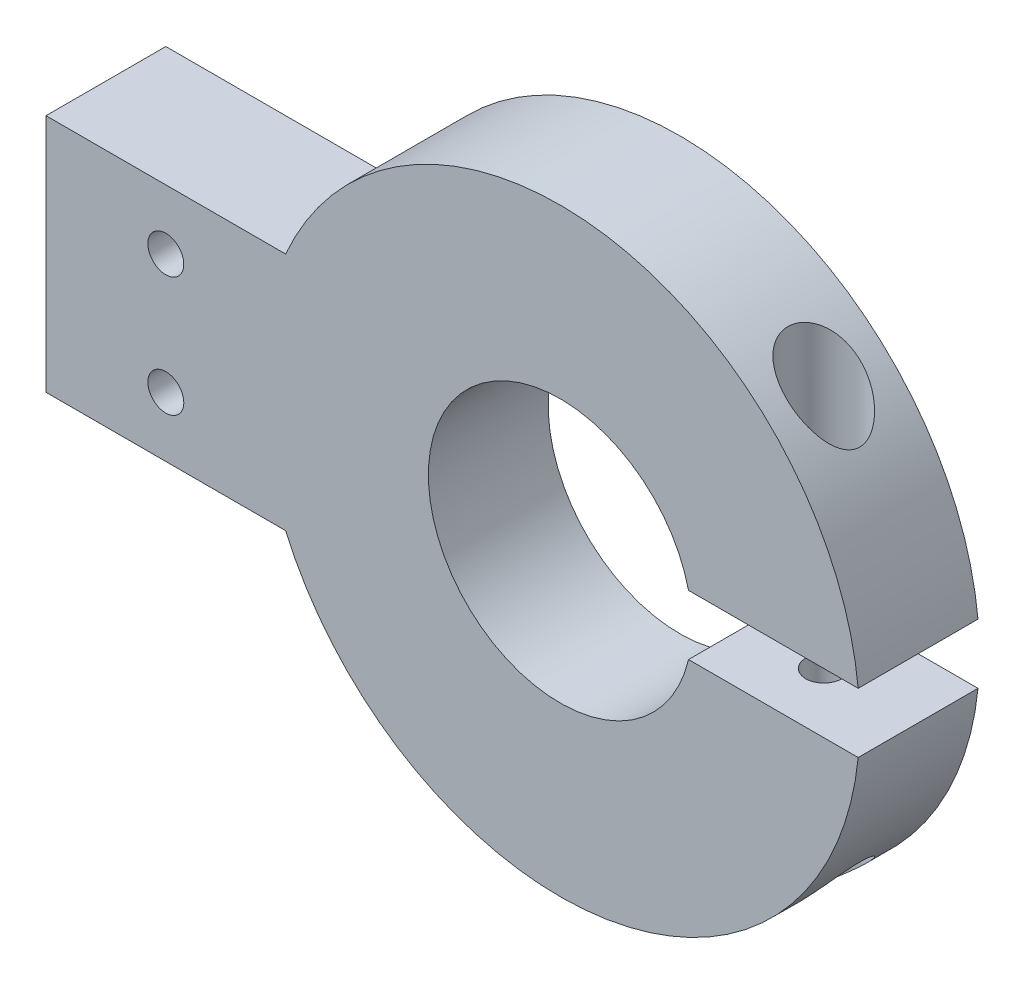
ISO-10303-21;
HEADER;
FILE_DESCRIPTION(('STEP AP214'),'2;1');
FILE_NAME('part.step','',(''),(''),'','','');
FILE_SCHEMA(('AUTOMOTIVE_DESIGN { 1 0 10303 214 1 1 1 1 }'));
ENDSEC;
DATA;
#1=APPLICATION_CONTEXT('core data for automotive mechanical design processes');
#2=APPLICATION_PROTOCOL_DEFINITION('international standard','automotive_design',2000,#1);
#3=PRODUCT_CONTEXT('',#1,'mechanical');
#4=PRODUCT('Part','Part','',(#3));
#5=PRODUCT_RELATED_PRODUCT_CATEGORY('part','',(#4));
#6=PRODUCT_DEFINITION_FORMATION('','',#4);
#7=PRODUCT_DEFINITION_CONTEXT('part definition',#1,'design');
#8=PRODUCT_DEFINITION('design','',#6,#7);
#9=PRODUCT_DEFINITION_SHAPE('','',#8);
#10=(LENGTH_UNIT() NAMED_UNIT(*) SI_UNIT(.MILLI.,.METRE.));
#11=(NAMED_UNIT(*) PLANE_ANGLE_UNIT() SI_UNIT($,.RADIAN.));
#12=(NAMED_UNIT(*) SI_UNIT($,.STERADIAN.) SOLID_ANGLE_UNIT());
#13=UNCERTAINTY_MEASURE_WITH_UNIT(LENGTH_MEASURE(1.E-05),#10,'distance_accuracy_value','');
#14=(GEOMETRIC_REPRESENTATION_CONTEXT(3) GLOBAL_UNCERTAINTY_ASSIGNED_CONTEXT((#13)) GLOBAL_UNIT_ASSIGNED_CONTEXT((#10,
#11,#12)) REPRESENTATION_CONTEXT('',''));
#15=CARTESIAN_POINT('',(0.,0.,0.));
#16=DIRECTION('',(0.,0.,1.));
#17=DIRECTION('',(1.,0.,0.));
#18=AXIS2_PLACEMENT_3D('',#15,#16,#17);
#19=CARTESIAN_POINT('',(0.,0.,10.));
#20=DIRECTION('',(0.,0.,-1.));
#21=DIRECTION('',(-1.,0.,0.));
#22=AXIS2_PLACEMENT_3D('',#19,#20,#21);
#23=CYLINDRICAL_SURFACE('',#22,25.);
#24=CARTESIAN_POINT('',(17.,-18.3303027798234,2.));
#25=CARTESIAN_POINT('',(16.8140401606612,-18.5027610612053,1.99999710766442));
#26=CARTESIAN_POINT('',(16.6252887721841,-18.6725190967379,2.01725510069127));
#27=CARTESIAN_POINT('',(16.2466179194314,-19.0029072495664,2.08974859336446));
#28=CARTESIAN_POINT('',(16.0566978815545,-19.1635324087441,2.14500451242364));
#29=CARTESIAN_POINT('',(15.715679786478,-19.4436925840915,2.28373094524258));
#30=CARTESIAN_POINT('',(15.5636823323292,-19.5654560347408,2.3604393755136));
#31=CARTESIAN_POINT('',(15.2686384883705,-19.7965560228225,2.54389492800638));
#32=CARTESIAN_POINT('',(15.1255791219454,-19.9059107733483,2.65059720426463));
#33=CARTESIAN_POINT('',(14.8787406156942,-20.090859398109,2.87329482187158));
#34=CARTESIAN_POINT('',(14.7724685271042,-20.1690124792044,2.98439656141839));
#35=CARTESIAN_POINT('',(14.5749790263628,-20.3121846634454,3.22696835875074));
#36=CARTESIAN_POINT('',(14.4837586889449,-20.3772063191987,3.358434449129));
#37=CARTESIAN_POINT('',(14.3617276532877,-20.4632184041301,3.56953368067486));
#38=CARTESIAN_POINT('',(14.3233845894027,-20.4900593351895,3.64256155323009));
#39=CARTESIAN_POINT('',(14.2524021670375,-20.5394960031247,3.79269465807995));
#40=CARTESIAN_POINT('',(14.2197598864147,-20.5620939153621,3.8697977749014));
#41=CARTESIAN_POINT('',(14.1607537005613,-20.6027751908885,4.02749624087493));
#42=CARTESIAN_POINT('',(14.134387674398,-20.6208600793622,4.10809039938735));
#43=CARTESIAN_POINT('',(14.0884118377558,-20.6522981194292,4.27204710051677));
#44=CARTESIAN_POINT('',(14.068800958028,-20.6656520198838,4.35540920271306));
#45=CARTESIAN_POINT('',(14.0249045268211,-20.6954889060972,4.58646288855546));
#46=CARTESIAN_POINT('',(14.0078303957098,-20.7070214388281,4.73627439883965));
#47=CARTESIAN_POINT('',(13.9964536707986,-20.7147128814954,5.03703103768131));
#48=CARTESIAN_POINT('',(14.0021404356776,-20.7108789756472,5.18797560356587));
#49=CARTESIAN_POINT('',(14.0347122077961,-20.6888178809743,5.47608336355922));
#50=CARTESIAN_POINT('',(14.0601438456167,-20.6715773838938,5.61349008313125));
#51=CARTESIAN_POINT('',(14.1290659442082,-20.6245295934783,5.88140694806694));
#52=CARTESIAN_POINT('',(14.1725566162263,-20.5947221531403,6.01191701273623));
#53=CARTESIAN_POINT('',(14.2769826443092,-20.5224727620665,6.26676722131207));
#54=CARTESIAN_POINT('',(14.3383938310575,-20.4796847201093,6.39081265151822));
#55=CARTESIAN_POINT('',(14.4752919981412,-20.3831530295275,6.62616353943635));
#56=CARTESIAN_POINT('',(14.5507832584469,-20.3294060492108,6.7374651067038));
#57=CARTESIAN_POINT('',(14.7217738262459,-20.2059798579109,6.9573270839997));
#58=CARTESIAN_POINT('',(14.8185568901493,-20.1352028497239,7.06426792156798));
#59=CARTESIAN_POINT('',(15.0221110894259,-19.9838018066207,7.26007679165523));
#60=CARTESIAN_POINT('',(15.1288887954216,-19.9031712830668,7.34893281138632));
#61=CARTESIAN_POINT('',(15.397511502096,-19.6966068632913,7.54367784467636));
#62=CARTESIAN_POINT('',(15.5629873823627,-19.5663011617983,7.63997459929427));
#63=CARTESIAN_POINT('',(15.9002716891272,-19.2932321579006,7.79739111981555));
#64=CARTESIAN_POINT('',(16.072091648245,-19.1504454505434,7.85844308985107));
#65=CARTESIAN_POINT('',(16.4630867506714,-18.8161941957753,7.96019842144821));
#66=CARTESIAN_POINT('',(16.682535465613,-18.6219874335363,7.9909726470543));
#67=CARTESIAN_POINT('',(17.0067573444802,-18.3246286825176,8.00194668666178));
#68=CARTESIAN_POINT('',(17.1140943297895,-18.2244141225281,7.99972342583997));
#69=CARTESIAN_POINT('',(17.3265662518856,-18.022529178901,7.98407288179903));
#70=CARTESIAN_POINT('',(17.4317011410941,-17.920858763888,7.97064535675691));
#71=CARTESIAN_POINT('',(17.745782169119,-17.6117548756196,7.91368162413629));
#72=CARTESIAN_POINT('',(17.9505631830615,-17.4028368009764,7.85338868473127));
#73=CARTESIAN_POINT('',(18.2458164096125,-17.0912515620385,7.73116828893516));
#74=CARTESIAN_POINT('',(18.3422734905596,-16.9876592711618,7.68511371351154));
#75=CARTESIAN_POINT('',(18.5308156092143,-16.7817840212504,7.5822726427827));
#76=CARTESIAN_POINT('',(18.6229017129689,-16.6795007474477,7.52548878126863));
#77=CARTESIAN_POINT('',(18.7816747944475,-16.5002910804935,7.41510586946804));
#78=CARTESIAN_POINT('',(18.8493743152936,-16.4228894447554,7.36372081906598));
#79=CARTESIAN_POINT('',(18.981435322334,-16.2700737456138,7.25416804068402));
#80=CARTESIAN_POINT('',(19.0457975354809,-16.1946592511344,7.19600179886747));
#81=CARTESIAN_POINT('',(19.1706791910293,-16.046632699335,7.0726424851318));
#82=CARTESIAN_POINT('',(19.2312033147313,-15.9740172721373,7.00745824557052));
#83=CARTESIAN_POINT('',(19.3478851400821,-15.8324904581072,6.86964749549217));
#84=CARTESIAN_POINT('',(19.4040447313489,-15.7635774723423,6.79702423761304));
#85=CARTESIAN_POINT('',(19.5279497391812,-15.6099860813251,6.62003354423605));
#86=CARTESIAN_POINT('',(19.5938728351622,-15.5270626514846,6.5128142432668));
#87=CARTESIAN_POINT('',(19.7144132882703,-15.3737244272893,6.28398724855298));
#88=CARTESIAN_POINT('',(19.7690479421946,-15.3032905196108,6.16240202329731));
#89=CARTESIAN_POINT('',(19.8526708407286,-15.194573283486,5.93456584845097));
#90=CARTESIAN_POINT('',(19.8846672979912,-15.152621163252,5.83119837280821));
#91=CARTESIAN_POINT('',(19.9378830161159,-15.0825319940879,5.61721728350213));
#92=CARTESIAN_POINT('',(19.9591136772785,-15.0543803323964,5.50661147554924));
#93=CARTESIAN_POINT('',(19.9891308883661,-15.0145031967716,5.27976441329737));
#94=CARTESIAN_POINT('',(19.9978129758637,-15.0029156216338,5.16348408948391));
#95=CARTESIAN_POINT('',(20.0014535144008,-14.9980623663559,4.93033268662636));
#96=CARTESIAN_POINT('',(19.9964160966312,-15.0047911708228,4.81346179599071));
#97=CARTESIAN_POINT('',(19.9746190070194,-15.0337901610751,4.59753336023283));
#98=CARTESIAN_POINT('',(19.9593607207109,-15.0540690642509,4.49803903952996));
#99=CARTESIAN_POINT('',(19.9198454849737,-15.1063174120926,4.30407348495149));
#100=CARTESIAN_POINT('',(19.8955840271615,-15.1382927136743,4.20960479483002));
#101=CARTESIAN_POINT('',(19.8264723336824,-15.228772767959,3.98484557993483));
#102=CARTESIAN_POINT('',(19.7772858066203,-15.2927137256035,3.85809069640699));
#103=CARTESIAN_POINT('',(19.6664528588186,-15.4349851807253,3.61887348279472));
#104=CARTESIAN_POINT('',(19.6047757644284,-15.5133510581236,3.50644747022361));
#105=CARTESIAN_POINT('',(19.4876491378043,-15.6600820231342,3.32052697539216));
#106=CARTESIAN_POINT('',(19.4341866898387,-15.7264171272796,3.24411975097954));
#107=CARTESIAN_POINT('',(19.3225526121867,-15.8633780393941,3.09891002507614));
#108=CARTESIAN_POINT('',(19.2643785589521,-15.9340060508216,3.03011148091881));
#109=CARTESIAN_POINT('',(19.1439089296849,-16.0785454288386,2.89963036503192));
#110=CARTESIAN_POINT('',(19.0816059022384,-16.1524626477902,2.83796124180929));
#111=CARTESIAN_POINT('',(18.9534622550349,-16.3026384963606,2.72151795915938));
#112=CARTESIAN_POINT('',(18.8876207176866,-16.3788977310824,2.66674560060141));
#113=CARTESIAN_POINT('',(18.7265208665326,-16.5631412392214,2.54377881587738));
#114=CARTESIAN_POINT('',(18.6297957175982,-16.6719103702089,2.47866891450942));
#115=CARTESIAN_POINT('',(18.4310650417788,-16.8913522810528,2.36079512362874));
#116=CARTESIAN_POINT('',(18.3290570965558,-17.0020259169873,2.30803695055364));
#117=CARTESIAN_POINT('',(18.12064310715,-17.2239781609855,2.21483159520541));
#118=CARTESIAN_POINT('',(18.014245652051,-17.3352552490465,2.17436155577982));
#119=CARTESIAN_POINT('',(17.7975342462368,-17.5576726952131,2.10572117160654));
#120=CARTESIAN_POINT('',(17.6872224339215,-17.6688130946731,2.07754421972849));
#121=CARTESIAN_POINT('',(17.4814361958058,-17.8722350545915,2.03734054728631));
#122=CARTESIAN_POINT('',(17.3864590696715,-17.9646501087993,2.02343497767206));
#123=CARTESIAN_POINT('',(17.1945781425598,-18.1483927612353,2.00476497835949));
#124=CARTESIAN_POINT('',(17.0976741381298,-18.2397202429852,2.00000151917955));
#125=CARTESIAN_POINT('',(17.,-18.3303027798234,2.));
#126=B_SPLINE_CURVE_WITH_KNOTS('',3,(#24,#25,#26,#27,#28,#29,#30,#31,#32,#33,#34,#35,#36,#37,
#38,#39,#40,#41,#42,#43,#44,#45,#46,#47,#48,#49,#50,#51,#52,#53,#54,#55,#56,#57,#58,#59,#60,#61,
#62,#63,#64,#65,#66,#67,#68,#69,#70,#71,#72,#73,#74,#75,#76,#77,#78,#79,#80,#81,#82,#83,#84,#85,
#86,#87,#88,#89,#90,#91,#92,#93,#94,#95,#96,#97,#98,#99,#100,#101,#102,#103,#104,#105,#106,#107,
#108,#109,#110,#111,#112,#113,#114,#115,#116,#117,#118,#119,#120,#121,#122,#123,#124,#125),
.UNSPECIFIED.,.T.,.F.,(4,2,2,2,2,2,2,2,2,2,2,2,2,2,2,2,2,2,2,2,2,2,2,2,2,2,2,2,2,2,2,2,2,2,2,2,
2,2,2,2,2,2,2,2,2,2,2,2,2,2,4),(0.,0.760508290018189,1.52142558342394,2.14707194049911,
2.77178777926202,3.28718426416111,3.8024804648925,4.06237576878921,4.32213746042552,
4.58181124586215,4.84144390951806,5.29247546328059,5.74329617249487,6.16375672385938,
6.58422219373865,7.0170648433462,7.45003928075283,7.93018247139456,8.41064356229434,
9.10159572046387,9.79387258360615,10.6728605778441,11.1130960399243,11.5533410039057,
12.4452871040273,12.891513896838,13.3376312932846,13.6822643735797,14.0268220657037,
14.3709510816066,14.7149302675909,15.1657941001381,15.6159618844939,15.9628298888269,
16.3093298106821,16.6586979299211,17.007960859744,17.3147136743027,17.621620304621,
18.0698486956874,18.5191914683013,18.8620658702229,19.2051177733245,19.5488065794431,
19.8925849436027,20.3702989684853,20.8482336465289,21.3252737940967,21.8020572314612,
22.2014666286436,22.6009184244303),.UNSPECIFIED.);
#127=CARTESIAN_POINT('',(17.,-18.3303027798234,2.));
#128=VERTEX_POINT('',#127);
#129=EDGE_CURVE('E38',#128,#128,#126,.T.);
#130=ORIENTED_EDGE('',*,*,#129,.T.);
#131=EDGE_LOOP('',(#130));
#132=FACE_BOUND('',#131,.T.);
#133=CARTESIAN_POINT('',(0.,0.,10.));
#134=DIRECTION('',(0.,0.,1.));
#135=DIRECTION('',(1.,0.,0.));
#136=AXIS2_PLACEMENT_3D('',#133,#134,#135);
#137=CIRCLE('',#136,25.);
#138=CARTESIAN_POINT('',(-22.9138692452306,-9.99772955287719,10.));
#139=VERTEX_POINT('',#138);
#140=CARTESIAN_POINT('',(24.8746859276655,-2.5,10.));
#141=VERTEX_POINT('',#140);
#142=EDGE_CURVE('E53',#139,#141,#137,.T.);
#143=ORIENTED_EDGE('',*,*,#142,.F.);
#144=DIRECTION('',(0.,0.,-1.));
#145=VECTOR('',#144,1.);
#146=CARTESIAN_POINT('',(-22.9138692452306,-9.9977295528772,10.));
#147=LINE('',#146,#145);
#148=CARTESIAN_POINT('',(-22.9138692452306,-9.9977295528772,0.));
#149=VERTEX_POINT('',#148);
#150=EDGE_CURVE('E152',#139,#149,#147,.T.);
#151=ORIENTED_EDGE('',*,*,#150,.T.);
#152=CARTESIAN_POINT('',(0.,0.,0.));
#153=DIRECTION('',(0.,0.,1.));
#154=DIRECTION('',(1.,0.,0.));
#155=AXIS2_PLACEMENT_3D('',#152,#153,#154);
#156=CIRCLE('',#155,25.);
#157=CARTESIAN_POINT('',(24.8746859276655,-2.5,0.));
#158=VERTEX_POINT('',#157);
#159=EDGE_CURVE('E255',#149,#158,#156,.T.);
#160=ORIENTED_EDGE('',*,*,#159,.T.);
#161=DIRECTION('',(0.,0.,-1.));
#162=VECTOR('',#161,1.);
#163=CARTESIAN_POINT('',(24.8746859276655,-2.5,10.));
#164=LINE('',#163,#162);
#165=EDGE_CURVE('E243',#158,#141,#164,.F.);
#166=ORIENTED_EDGE('',*,*,#165,.T.);
#167=EDGE_LOOP('',(#143,#151,#160,#166));
#168=FACE_BOUND('',#167,.T.);
#169=ADVANCED_FACE('F33',(#132,#168),#23,.T.);
#170=CARTESIAN_POINT('',(18.1547005383792,-7.49999999999998,7.));
#171=DIRECTION('',(-0.866025403784439,0.,-0.5));
#172=DIRECTION('',(-0.5,0.,0.866025403784439));
#173=AXIS2_PLACEMENT_3D('',#170,#171,#172);
#174=PLANE('',#173);
#175=DIRECTION('',(0.,-1.,0.));
#176=VECTOR('',#175,1.);
#177=CARTESIAN_POINT('',(19.3094010767585,-7.49999999999998,5.));
#178=LINE('',#177,#176);
#179=CARTESIAN_POINT('',(19.3094010767585,-7.49999999999998,5.));
#180=VERTEX_POINT('',#179);
#181=CARTESIAN_POINT('',(19.3094010767585,-12.5,5.));
#182=VERTEX_POINT('',#181);
#183=EDGE_CURVE('E223',#180,#182,#178,.T.);
#184=ORIENTED_EDGE('',*,*,#183,.T.);
#185=DIRECTION('',(-0.5,0.,0.866025403784439));
#186=VECTOR('',#185,1.);
#187=CARTESIAN_POINT('',(18.1547005383792,-12.5,7.));
#188=LINE('',#187,#186);
#189=CARTESIAN_POINT('',(18.1547005383792,-12.5,7.));
#190=VERTEX_POINT('',#189);
#191=EDGE_CURVE('E192',#182,#190,#188,.T.);
#192=ORIENTED_EDGE('',*,*,#191,.T.);
#193=DIRECTION('',(0.,-1.,0.));
#194=VECTOR('',#193,1.);
#195=CARTESIAN_POINT('',(18.1547005383792,-7.49999999999998,7.));
#196=LINE('',#195,#194);
#197=CARTESIAN_POINT('',(18.1547005383792,-7.49999999999998,7.));
#198=VERTEX_POINT('',#197);
#199=EDGE_CURVE('E208',#198,#190,#196,.T.);
#200=ORIENTED_EDGE('',*,*,#199,.F.);
#201=DIRECTION('',(0.5,0.,-0.866025403784439));
#202=VECTOR('',#201,1.);
#203=CARTESIAN_POINT('',(18.1547005383792,-7.49999999999998,7.));
#204=LINE('',#203,#202);
#205=EDGE_CURVE('E195',#198,#180,#204,.T.);
#206=ORIENTED_EDGE('',*,*,#205,.T.);
#207=EDGE_LOOP('',(#184,#192,#200,#206));
#208=FACE_BOUND('',#207,.T.);
#209=ADVANCED_FACE('F308',(#208),#174,.T.);
#210=CARTESIAN_POINT('',(19.3094010767585,-7.49999999999998,5.));
#211=DIRECTION('',(-0.866025403784438,0.,0.5));
#212=DIRECTION('',(0.5,0.,0.866025403784438));
#213=AXIS2_PLACEMENT_3D('',#210,#211,#212);
#214=PLANE('',#213);
#215=DIRECTION('',(0.,-1.,0.));
#216=VECTOR('',#215,1.);
#217=CARTESIAN_POINT('',(18.1547005383792,-7.49999999999998,3.));
#218=LINE('',#217,#216);
#219=CARTESIAN_POINT('',(18.1547005383792,-7.49999999999998,3.));
#220=VERTEX_POINT('',#219);
#221=CARTESIAN_POINT('',(18.1547005383792,-12.5,3.));
#222=VERTEX_POINT('',#221);
#223=EDGE_CURVE('E220',#220,#222,#218,.T.);
#224=ORIENTED_EDGE('',*,*,#223,.T.);
#225=DIRECTION('',(0.5,0.,0.866025403784438));
#226=VECTOR('',#225,1.);
#227=CARTESIAN_POINT('',(19.3094010767585,-12.5,5.));
#228=LINE('',#227,#226);
#229=EDGE_CURVE('E189',#222,#182,#228,.T.);
#230=ORIENTED_EDGE('',*,*,#229,.T.);
#231=ORIENTED_EDGE('',*,*,#183,.F.);
#232=DIRECTION('',(-0.5,0.,-0.866025403784438));
#233=VECTOR('',#232,1.);
#234=CARTESIAN_POINT('',(19.3094010767585,-7.49999999999998,5.));
#235=LINE('',#234,#233);
#236=EDGE_CURVE('E198',#180,#220,#235,.T.);
#237=ORIENTED_EDGE('',*,*,#236,.T.);
#238=EDGE_LOOP('',(#224,#230,#231,#237));
#239=FACE_BOUND('',#238,.T.);
#240=ADVANCED_FACE('F313',(#239),#214,.T.);
#241=CARTESIAN_POINT('',(18.1547005383792,-7.49999999999998,3.));
#242=DIRECTION('',(0.,0.,1.));
#243=DIRECTION('',(1.,0.,0.));
#244=AXIS2_PLACEMENT_3D('',#241,#242,#243);
#245=PLANE('',#244);
#246=DIRECTION('',(0.,-1.,0.));
#247=VECTOR('',#246,1.);
#248=CARTESIAN_POINT('',(15.8452994616208,-7.49999999999998,3.));
#249=LINE('',#248,#247);
#250=CARTESIAN_POINT('',(15.8452994616208,-7.49999999999998,3.));
#251=VERTEX_POINT('',#250);
#252=CARTESIAN_POINT('',(15.8452994616208,-12.5,3.));
#253=VERTEX_POINT('',#252);
#254=EDGE_CURVE('E217',#251,#253,#249,.T.);
#255=ORIENTED_EDGE('',*,*,#254,.T.);
#256=DIRECTION('',(1.,0.,0.));
#257=VECTOR('',#256,1.);
#258=CARTESIAN_POINT('',(18.1547005383792,-12.5,3.));
#259=LINE('',#258,#257);
#260=EDGE_CURVE('E186',#253,#222,#259,.T.);
#261=ORIENTED_EDGE('',*,*,#260,.T.);
#262=ORIENTED_EDGE('',*,*,#223,.F.);
#263=DIRECTION('',(-1.,0.,0.));
#264=VECTOR('',#263,1.);
#265=CARTESIAN_POINT('',(18.1547005383792,-7.49999999999998,3.));
#266=LINE('',#265,#264);
#267=EDGE_CURVE('E200',#220,#251,#266,.T.);
#268=ORIENTED_EDGE('',*,*,#267,.T.);
#269=EDGE_LOOP('',(#255,#261,#262,#268));
#270=FACE_BOUND('',#269,.T.);
#271=ADVANCED_FACE('F396',(#270),#245,.T.);
#272=CARTESIAN_POINT('',(15.8452994616208,-7.49999999999998,3.));
#273=DIRECTION('',(0.866025403784438,0.,0.500000000000002));
#274=DIRECTION('',(0.500000000000002,0.,-0.866025403784438));
#275=AXIS2_PLACEMENT_3D('',#272,#273,#274);
#276=PLANE('',#275);
#277=DIRECTION('',(0.,-1.,0.));
#278=VECTOR('',#277,1.);
#279=CARTESIAN_POINT('',(14.6905989232415,-7.49999999999998,5.));
#280=LINE('',#279,#278);
#281=CARTESIAN_POINT('',(14.6905989232415,-7.49999999999998,5.));
#282=VERTEX_POINT('',#281);
#283=CARTESIAN_POINT('',(14.6905989232415,-12.5,5.));
#284=VERTEX_POINT('',#283);
#285=EDGE_CURVE('E214',#282,#284,#280,.T.);
#286=ORIENTED_EDGE('',*,*,#285,.T.);
#287=DIRECTION('',(0.500000000000002,0.,-0.866025403784438));
#288=VECTOR('',#287,1.);
#289=CARTESIAN_POINT('',(15.8452994616208,-12.5,3.));
#290=LINE('',#289,#288);
#291=EDGE_CURVE('E183',#284,#253,#290,.T.);
#292=ORIENTED_EDGE('',*,*,#291,.T.);
#293=ORIENTED_EDGE('',*,*,#254,.F.);
#294=DIRECTION('',(-0.500000000000002,0.,0.866025403784437));
#295=VECTOR('',#294,1.);
#296=CARTESIAN_POINT('',(15.8452994616208,-7.49999999999998,3.));
#297=LINE('',#296,#295);
#298=EDGE_CURVE('E202',#251,#282,#297,.T.);
#299=ORIENTED_EDGE('',*,*,#298,.T.);
#300=EDGE_LOOP('',(#286,#292,#293,#299));
#301=FACE_BOUND('',#300,.T.);
#302=ADVANCED_FACE('F392',(#301),#276,.T.);
#303=CARTESIAN_POINT('',(14.6905989232415,-7.49999999999998,5.));
#304=DIRECTION('',(0.866025403784438,0.,-0.500000000000002));
#305=DIRECTION('',(-0.500000000000002,0.,-0.866025403784438));
#306=AXIS2_PLACEMENT_3D('',#303,#304,#305);
#307=PLANE('',#306);
#308=DIRECTION('',(0.,-1.,0.));
#309=VECTOR('',#308,1.);
#310=CARTESIAN_POINT('',(15.8452994616208,-7.49999999999998,7.));
#311=LINE('',#310,#309);
#312=CARTESIAN_POINT('',(15.8452994616208,-7.49999999999998,7.));
#313=VERTEX_POINT('',#312);
#314=CARTESIAN_POINT('',(15.8452994616208,-12.5,7.));
#315=VERTEX_POINT('',#314);
#316=EDGE_CURVE('E211',#313,#315,#311,.T.);
#317=ORIENTED_EDGE('',*,*,#316,.T.);
#318=DIRECTION('',(-0.500000000000002,0.,-0.866025403784438));
#319=VECTOR('',#318,1.);
#320=CARTESIAN_POINT('',(14.6905989232415,-12.5,5.));
#321=LINE('',#320,#319);
#322=EDGE_CURVE('E180',#315,#284,#321,.T.);
#323=ORIENTED_EDGE('',*,*,#322,.T.);
#324=ORIENTED_EDGE('',*,*,#285,.F.);
#325=DIRECTION('',(0.500000000000002,0.,0.866025403784437));
#326=VECTOR('',#325,1.);
#327=CARTESIAN_POINT('',(14.6905989232415,-7.49999999999998,5.));
#328=LINE('',#327,#326);
#329=EDGE_CURVE('E204',#282,#313,#328,.T.);
#330=ORIENTED_EDGE('',*,*,#329,.T.);
#331=EDGE_LOOP('',(#317,#323,#324,#330));
#332=FACE_BOUND('',#331,.T.);
#333=ADVANCED_FACE('F323',(#332),#307,.T.);
#334=CARTESIAN_POINT('',(15.8452994616208,-7.49999999999998,7.));
#335=DIRECTION('',(0.,0.,-1.));
#336=DIRECTION('',(-1.,0.,0.));
#337=AXIS2_PLACEMENT_3D('',#334,#335,#336);
#338=PLANE('',#337);
#339=ORIENTED_EDGE('',*,*,#199,.T.);
#340=DIRECTION('',(-1.,0.,0.));
#341=VECTOR('',#340,1.);
#342=CARTESIAN_POINT('',(15.8452994616208,-12.5,7.));
#343=LINE('',#342,#341);
#344=EDGE_CURVE('E11',#190,#315,#343,.T.);
#345=ORIENTED_EDGE('',*,*,#344,.T.);
#346=ORIENTED_EDGE('',*,*,#316,.F.);
#347=DIRECTION('',(1.,0.,0.));
#348=VECTOR('',#347,1.);
#349=CARTESIAN_POINT('',(15.8452994616208,-7.49999999999998,7.));
#350=LINE('',#349,#348);
#351=EDGE_CURVE('E206',#313,#198,#350,.T.);
#352=ORIENTED_EDGE('',*,*,#351,.T.);
#353=EDGE_LOOP('',(#339,#345,#346,#352));
#354=FACE_BOUND('',#353,.T.);
#355=ADVANCED_FACE('F317',(#354),#338,.T.);
#356=CARTESIAN_POINT('',(24.8746859276655,2.5,0.));
#357=VERTEX_POINT('',#356);
#358=CARTESIAN_POINT('',(-22.9138692452306,9.99772955287719,0.));
#359=VERTEX_POINT('',#358);
#360=EDGE_CURVE('E261',#357,#359,#156,.T.);
#361=ORIENTED_EDGE('',*,*,#360,.T.);
#362=DIRECTION('',(0.,0.,-1.));
#363=VECTOR('',#362,1.);
#364=CARTESIAN_POINT('',(-22.9138692452306,9.9977295528772,10.));
#365=LINE('',#364,#363);
#366=CARTESIAN_POINT('',(-22.9138692452306,9.99772955287719,10.));
#367=VERTEX_POINT('',#366);
#368=EDGE_CURVE('E61',#367,#359,#365,.T.);
#369=ORIENTED_EDGE('',*,*,#368,.F.);
#370=CARTESIAN_POINT('',(24.8746859276655,2.5,10.));
#371=VERTEX_POINT('',#370);
#372=EDGE_CURVE('E258',#371,#367,#137,.T.);
#373=ORIENTED_EDGE('',*,*,#372,.F.);
#374=DIRECTION('',(0.,0.,-1.));
#375=VECTOR('',#374,1.);
#376=CARTESIAN_POINT('',(24.8746859276655,2.5,10.));
#377=LINE('',#376,#375);
#378=EDGE_CURVE('E248',#371,#357,#377,.T.);
#379=ORIENTED_EDGE('',*,*,#378,.T.);
#380=EDGE_LOOP('',(#361,#369,#373,#379));
#381=FACE_BOUND('',#380,.T.);
#382=CARTESIAN_POINT('',(17.,18.3303027798234,8.));
#383=CARTESIAN_POINT('',(16.8140401606612,18.5027610612053,8.00000289233558));
#384=CARTESIAN_POINT('',(16.6252887721841,18.6725190967379,7.98274489930873));
#385=CARTESIAN_POINT('',(16.2466179194314,19.0029072495664,7.91025140663554));
#386=CARTESIAN_POINT('',(16.0566978815545,19.1635324087441,7.85499548757636));
#387=CARTESIAN_POINT('',(15.715679786478,19.4436925840915,7.71626905475742));
#388=CARTESIAN_POINT('',(15.5636823323292,19.5654560347408,7.63956062448641));
#389=CARTESIAN_POINT('',(15.2686384883705,19.7965560228225,7.45610507199363));
#390=CARTESIAN_POINT('',(15.1255791219454,19.9059107733483,7.34940279573537));
#391=CARTESIAN_POINT('',(14.8787406156942,20.090859398109,7.12670517812842));
#392=CARTESIAN_POINT('',(14.7724685271042,20.1690124792044,7.01560343858161));
#393=CARTESIAN_POINT('',(14.5749790263628,20.3121846634454,6.77303164124926));
#394=CARTESIAN_POINT('',(14.4837586889449,20.3772063191987,6.64156555087099));
#395=CARTESIAN_POINT('',(14.3617276532877,20.4632184041301,6.43046631932514));
#396=CARTESIAN_POINT('',(14.3233845894027,20.4900593351895,6.35743844676991));
#397=CARTESIAN_POINT('',(14.2524021670375,20.5394960031247,6.20730534192005));
#398=CARTESIAN_POINT('',(14.2197598864147,20.5620939153621,6.13020222509859));
#399=CARTESIAN_POINT('',(14.1607537005613,20.6027751908885,5.97250375912507));
#400=CARTESIAN_POINT('',(14.134387674398,20.6208600793622,5.89190960061265));
#401=CARTESIAN_POINT('',(14.0884118377558,20.6522981194292,5.72795289948323));
#402=CARTESIAN_POINT('',(14.068800958028,20.6656520198838,5.64459079728694));
#403=CARTESIAN_POINT('',(14.0249045268211,20.6954889060972,5.41353711144453));
#404=CARTESIAN_POINT('',(14.0078303957098,20.7070214388281,5.26372560116034));
#405=CARTESIAN_POINT('',(13.9964536707986,20.7147128814954,4.96296896231868));
#406=CARTESIAN_POINT('',(14.0021404356776,20.7108789756472,4.81202439643412));
#407=CARTESIAN_POINT('',(14.0347122077961,20.6888178809743,4.52391663644077));
#408=CARTESIAN_POINT('',(14.0601438456167,20.6715773838938,4.38650991686875));
#409=CARTESIAN_POINT('',(14.1290659442082,20.6245295934783,4.11859305193305));
#410=CARTESIAN_POINT('',(14.1725566162263,20.5947221531403,3.98808298726377));
#411=CARTESIAN_POINT('',(14.2769826443092,20.5224727620665,3.73323277868793));
#412=CARTESIAN_POINT('',(14.3383938310575,20.4796847201093,3.60918734848177));
#413=CARTESIAN_POINT('',(14.4752919981412,20.3831530295275,3.37383646056365));
#414=CARTESIAN_POINT('',(14.5507832584469,20.3294060492108,3.2625348932962));
#415=CARTESIAN_POINT('',(14.721773826246,20.2059798579109,3.0426729160003));
#416=CARTESIAN_POINT('',(14.8185568901493,20.1352028497238,2.93573207843202));
#417=CARTESIAN_POINT('',(15.0221110894259,19.9838018066207,2.73992320834477));
#418=CARTESIAN_POINT('',(15.1288887954216,19.9031712830668,2.65106718861368));
#419=CARTESIAN_POINT('',(15.397511502096,19.6966068632913,2.45632215532364));
#420=CARTESIAN_POINT('',(15.5629873823627,19.5663011617983,2.36002540070573));
#421=CARTESIAN_POINT('',(15.9002716891272,19.2932321579006,2.20260888018445));
#422=CARTESIAN_POINT('',(16.072091648245,19.1504454505433,2.14155691014892));
#423=CARTESIAN_POINT('',(16.4630867506714,18.8161941957753,2.03980157855179));
#424=CARTESIAN_POINT('',(16.682535465613,18.6219874335363,2.0090273529457));
#425=CARTESIAN_POINT('',(17.0067573444802,18.3246286825176,1.99805331333822));
#426=CARTESIAN_POINT('',(17.1140943297895,18.2244141225281,2.00027657416004));
#427=CARTESIAN_POINT('',(17.3265662518856,18.022529178901,2.01592711820097));
#428=CARTESIAN_POINT('',(17.4317011410941,17.920858763888,2.02935464324309));
#429=CARTESIAN_POINT('',(17.745782169119,17.6117548756196,2.08631837586372));
#430=CARTESIAN_POINT('',(17.9505631830615,17.4028368009764,2.14661131526873));
#431=CARTESIAN_POINT('',(18.2458164096125,17.0912515620385,2.26883171106484));
#432=CARTESIAN_POINT('',(18.3422734905596,16.9876592711618,2.31488628648846));
#433=CARTESIAN_POINT('',(18.5308156092143,16.7817840212504,2.4177273572173));
#434=CARTESIAN_POINT('',(18.6229017129689,16.6795007474477,2.47451121873137));
#435=CARTESIAN_POINT('',(18.7816747944475,16.5002910804935,2.58489413053197));
#436=CARTESIAN_POINT('',(18.8493743152936,16.4228894447554,2.63627918093403));
#437=CARTESIAN_POINT('',(18.981435322334,16.2700737456138,2.74583195931599));
#438=CARTESIAN_POINT('',(19.0457975354809,16.1946592511344,2.80399820113254));
#439=CARTESIAN_POINT('',(19.1706791910293,16.046632699335,2.92735751486821));
#440=CARTESIAN_POINT('',(19.2312033147313,15.9740172721373,2.99254175442949));
#441=CARTESIAN_POINT('',(19.3478851400821,15.8324904581072,3.13035250450784));
#442=CARTESIAN_POINT('',(19.4040447313489,15.7635774723423,3.20297576238697));
#443=CARTESIAN_POINT('',(19.5279497391812,15.6099860813251,3.37996645576396));
#444=CARTESIAN_POINT('',(19.5938728351622,15.5270626514846,3.48718575673321));
#445=CARTESIAN_POINT('',(19.7144132882703,15.3737244272893,3.71601275144703));
#446=CARTESIAN_POINT('',(19.7690479421946,15.3032905196108,3.83759797670269));
#447=CARTESIAN_POINT('',(19.8526708407286,15.194573283486,4.06543415154903));
#448=CARTESIAN_POINT('',(19.8846672979912,15.152621163252,4.1688016271918));
#449=CARTESIAN_POINT('',(19.9378830161159,15.0825319940879,4.38278271649788));
#450=CARTESIAN_POINT('',(19.9591136772785,15.0543803323964,4.49338852445076));
#451=CARTESIAN_POINT('',(19.9891308883661,15.0145031967716,4.72023558670264));
#452=CARTESIAN_POINT('',(19.9978129758637,15.0029156216338,4.8365159105161));
#453=CARTESIAN_POINT('',(20.0014535144008,14.9980623663559,5.06966731337365));
#454=CARTESIAN_POINT('',(19.9964160966312,15.0047911708228,5.18653820400929));
#455=CARTESIAN_POINT('',(19.9746190070194,15.0337901610751,5.40246663976717));
#456=CARTESIAN_POINT('',(19.9593607207109,15.0540690642509,5.50196096047004));
#457=CARTESIAN_POINT('',(19.9198454849737,15.1063174120926,5.69592651504851));
#458=CARTESIAN_POINT('',(19.8955840271615,15.1382927136743,5.79039520516998));
#459=CARTESIAN_POINT('',(19.8264723336824,15.228772767959,6.01515442006517));
#460=CARTESIAN_POINT('',(19.7772858066203,15.2927137256035,6.141909303593));
#461=CARTESIAN_POINT('',(19.6664528588186,15.4349851807253,6.38112651720527));
#462=CARTESIAN_POINT('',(19.6047757644284,15.5133510581236,6.49355252977639));
#463=CARTESIAN_POINT('',(19.4876491378043,15.6600820231342,6.67947302460784));
#464=CARTESIAN_POINT('',(19.4341866898387,15.7264171272796,6.75588024902046));
#465=CARTESIAN_POINT('',(19.3225526121867,15.8633780393941,6.90108997492385));
#466=CARTESIAN_POINT('',(19.2643785589521,15.9340060508216,6.96988851908118));
#467=CARTESIAN_POINT('',(19.1439089296849,16.0785454288386,7.10036963496807));
#468=CARTESIAN_POINT('',(19.0816059022384,16.1524626477902,7.16203875819071));
#469=CARTESIAN_POINT('',(18.9534622550349,16.3026384963605,7.27848204084061));
#470=CARTESIAN_POINT('',(18.8876207176866,16.3788977310824,7.33325439939858));
#471=CARTESIAN_POINT('',(18.7265208665326,16.5631412392214,7.45622118412262));
#472=CARTESIAN_POINT('',(18.6297957175982,16.6719103702089,7.52133108549057));
#473=CARTESIAN_POINT('',(18.4310650417788,16.8913522810528,7.63920487637126));
#474=CARTESIAN_POINT('',(18.3290570965558,17.0020259169873,7.69196304944636));
#475=CARTESIAN_POINT('',(18.12064310715,17.2239781609855,7.78516840479459));
#476=CARTESIAN_POINT('',(18.014245652051,17.3352552490465,7.82563844422017));
#477=CARTESIAN_POINT('',(17.7975342462368,17.5576726952131,7.89427882839346));
#478=CARTESIAN_POINT('',(17.6872224339215,17.6688130946731,7.92245578027151));
#479=CARTESIAN_POINT('',(17.4814361958058,17.8722350545915,7.96265945271369));
#480=CARTESIAN_POINT('',(17.3864590696715,17.9646501087993,7.97656502232794));
#481=CARTESIAN_POINT('',(17.1945781425598,18.1483927612353,7.99523502164051));
#482=CARTESIAN_POINT('',(17.0976741381298,18.2397202429852,7.99999848082045));
#483=CARTESIAN_POINT('',(17.,18.3303027798234,8.));
#484=B_SPLINE_CURVE_WITH_KNOTS('',3,(#382,#383,#384,#385,#386,#387,#388,#389,#390,#391,#392,
#393,#394,#395,#396,#397,#398,#399,#400,#401,#402,#403,#404,#405,#406,#407,#408,#409,#410,#411,
#412,#413,#414,#415,#416,#417,#418,#419,#420,#421,#422,#423,#424,#425,#426,#427,#428,#429,#430,
#431,#432,#433,#434,#435,#436,#437,#438,#439,#440,#441,#442,#443,#444,#445,#446,#447,#448,#449,
#450,#451,#452,#453,#454,#455,#456,#457,#458,#459,#460,#461,#462,#463,#464,#465,#466,#467,#468,
#469,#470,#471,#472,#473,#474,#475,#476,#477,#478,#479,#480,#481,#482,#483),.UNSPECIFIED.,.T.,
.F.,(4,2,2,2,2,2,2,2,2,2,2,2,2,2,2,2,2,2,2,2,2,2,2,2,2,2,2,2,2,2,2,2,2,2,2,2,2,2,2,2,2,2,2,2,2,
2,2,2,2,2,4),(0.,0.760508290018189,1.52142558342393,2.1470719404991,2.77178777926202,
3.28718426416112,3.80248046489251,4.06237576878922,4.32213746042552,4.58181124586216,
4.84144390951806,5.29247546328059,5.74329617249488,6.16375672385939,6.58422219373866,
7.01706484334621,7.45003928075283,7.93018247139457,8.41064356229435,9.10159572046388,
9.79387258360616,10.6728605778441,11.1130960399243,11.5533410039057,12.4452871040273,
12.891513896838,13.3376312932846,13.6822643735798,14.0268220657037,14.3709510816066,
14.7149302675909,15.1657941001381,15.6159618844939,15.9628298888269,16.3093298106821,
16.6586979299211,17.007960859744,17.3147136743027,17.621620304621,18.0698486956874,
18.5191914683013,18.8620658702228,19.2051177733245,19.548806579443,19.8925849436027,
20.3702989684853,20.8482336465289,21.3252737940967,21.8020572314612,22.2014666286436,
22.6009184244303),.UNSPECIFIED.);
#485=CARTESIAN_POINT('',(17.,18.3303027798234,8.));
#486=VERTEX_POINT('',#485);
#487=EDGE_CURVE('E267',#486,#486,#484,.T.);
#488=ORIENTED_EDGE('',*,*,#487,.T.);
#489=EDGE_LOOP('',(#488));
#490=FACE_BOUND('',#489,.T.);
#491=ADVANCED_FACE('F35',(#381,#490),#23,.T.);
#492=CARTESIAN_POINT('',(17.,-25.,5.));
#493=DIRECTION('',(0.,1.,0.));
#494=DIRECTION('',(0.,0.,1.));
#495=AXIS2_PLACEMENT_3D('',#492,#493,#494);
#496=CYLINDRICAL_SURFACE('',#495,1.5);
#497=CARTESIAN_POINT('',(17.,2.5,5.));
#498=DIRECTION('',(0.,1.,0.));
#499=DIRECTION('',(-1.,0.,0.));
#500=AXIS2_PLACEMENT_3D('',#497,#498,#499);
#501=CIRCLE('',#500,1.5);
#502=CARTESIAN_POINT('',(15.5,2.5,5.));
#503=VERTEX_POINT('',#502);
#504=EDGE_CURVE('E235',#503,#503,#501,.T.);
#505=ORIENTED_EDGE('',*,*,#504,.F.);
#506=EDGE_LOOP('',(#505));
#507=FACE_BOUND('',#506,.T.);
#508=CARTESIAN_POINT('',(17.,7.49999999999999,5.));
#509=DIRECTION('',(0.,1.,0.));
#510=DIRECTION('',(0.,0.,1.));
#511=AXIS2_PLACEMENT_3D('',#508,#509,#510);
#512=CIRCLE('',#511,1.5);
#513=CARTESIAN_POINT('',(17.,7.49999999999999,6.5));
#514=VERTEX_POINT('',#513);
#515=EDGE_CURVE('E230',#514,#514,#512,.F.);
#516=ORIENTED_EDGE('',*,*,#515,.F.);
#517=EDGE_LOOP('',(#516));
#518=FACE_BOUND('',#517,.T.);
#519=ADVANCED_FACE('F288',(#507,#518),#496,.F.);
#520=CARTESIAN_POINT('',(0.,0.,10.));
#521=DIRECTION('',(0.,0.,1.));
#522=DIRECTION('',(1.,0.,0.));
#523=AXIS2_PLACEMENT_3D('',#520,#521,#522);
#524=PLANE('',#523);
#525=ORIENTED_EDGE('',*,*,#372,.T.);
#526=DIRECTION('',(1.,0.,0.));
#527=VECTOR('',#526,1.);
#528=CARTESIAN_POINT('',(-42.9138692452306,9.9977295528772,10.));
#529=LINE('',#528,#527);
#530=CARTESIAN_POINT('',(-42.9138692452306,9.9977295528772,10.));
#531=VERTEX_POINT('',#530);
#532=EDGE_CURVE('E158',#531,#367,#529,.T.);
#533=ORIENTED_EDGE('',*,*,#532,.F.);
#534=DIRECTION('',(0.,1.,0.));
#535=VECTOR('',#534,1.);
#536=CARTESIAN_POINT('',(-42.9138692452306,-9.99772955287719,10.));
#537=LINE('',#536,#535);
#538=CARTESIAN_POINT('',(-42.9138692452306,-9.99772955287719,10.));
#539=VERTEX_POINT('',#538);
#540=EDGE_CURVE('E145',#539,#531,#537,.T.);
#541=ORIENTED_EDGE('',*,*,#540,.F.);
#542=DIRECTION('',(-1.,0.,0.));
#543=VECTOR('',#542,1.);
#544=CARTESIAN_POINT('',(-22.9138692452306,-9.9977295528772,10.));
#545=LINE('',#544,#543);
#546=EDGE_CURVE('E155',#139,#539,#545,.T.);
#547=ORIENTED_EDGE('',*,*,#546,.F.);
#548=ORIENTED_EDGE('',*,*,#142,.T.);
#549=DIRECTION('',(1.,0.,0.));
#550=VECTOR('',#549,1.);
#551=CARTESIAN_POINT('',(0.,-2.5,10.));
#552=LINE('',#551,#550);
#553=CARTESIAN_POINT('',(10.7121426428143,-2.5,10.));
#554=VERTEX_POINT('',#553);
#555=EDGE_CURVE('E234',#554,#141,#552,.T.);
#556=ORIENTED_EDGE('',*,*,#555,.F.);
#557=CARTESIAN_POINT('',(0.,0.,10.));
#558=DIRECTION('',(0.,0.,1.));
#559=DIRECTION('',(1.,0.,0.));
#560=AXIS2_PLACEMENT_3D('',#557,#558,#559);
#561=CIRCLE('',#560,11.);
#562=CARTESIAN_POINT('',(10.7121426428143,2.5,10.));
#563=VERTEX_POINT('',#562);
#564=EDGE_CURVE('E252',#563,#554,#561,.T.);
#565=ORIENTED_EDGE('',*,*,#564,.F.);
#566=DIRECTION('',(-1.,0.,0.));
#567=VECTOR('',#566,1.);
#568=CARTESIAN_POINT('',(25.,2.5,10.));
#569=LINE('',#568,#567);
#570=EDGE_CURVE('E240',#371,#563,#569,.T.);
#571=ORIENTED_EDGE('',*,*,#570,.F.);
#572=EDGE_LOOP('',(#525,#533,#541,#547,#548,#556,#565,#571));
#573=FACE_BOUND('',#572,.T.);
#574=CARTESIAN_POINT('',(-32.9138692452306,-5.,10.));
#575=DIRECTION('',(0.,0.,-1.));
#576=DIRECTION('',(1.,0.,0.));
#577=AXIS2_PLACEMENT_3D('',#574,#575,#576);
#578=CIRCLE('',#577,1.5);
#579=CARTESIAN_POINT('',(-31.4138692452306,-5.,10.));
#580=VERTEX_POINT('',#579);
#581=EDGE_CURVE('E346',#580,#580,#578,.T.);
#582=ORIENTED_EDGE('',*,*,#581,.T.);
#583=EDGE_LOOP('',(#582));
#584=FACE_BOUND('',#583,.T.);
#585=CARTESIAN_POINT('',(-32.9138692452306,5.,10.));
#586=DIRECTION('',(0.,0.,-1.));
#587=DIRECTION('',(-1.,0.,0.));
#588=AXIS2_PLACEMENT_3D('',#585,#586,#587);
#589=CIRCLE('',#588,1.5);
#590=CARTESIAN_POINT('',(-34.4138692452306,5.,10.));
#591=VERTEX_POINT('',#590);
#592=EDGE_CURVE('E172',#591,#591,#589,.T.);
#593=ORIENTED_EDGE('',*,*,#592,.T.);
#594=EDGE_LOOP('',(#593));
#595=FACE_BOUND('',#594,.T.);
#596=ADVANCED_FACE('F161',(#573,#584,#595),#524,.T.);
#597=CARTESIAN_POINT('',(0.,0.,0.));
#598=DIRECTION('',(0.,0.,1.));
#599=DIRECTION('',(1.,0.,0.));
#600=AXIS2_PLACEMENT_3D('',#597,#598,#599);
#601=PLANE('',#600);
#602=ORIENTED_EDGE('',*,*,#159,.F.);
#603=DIRECTION('',(-1.,0.,0.));
#604=VECTOR('',#603,1.);
#605=CARTESIAN_POINT('',(-22.9138692452306,-9.9977295528772,0.));
#606=LINE('',#605,#604);
#607=CARTESIAN_POINT('',(-42.9138692452306,-9.99772955287719,0.));
#608=VERTEX_POINT('',#607);
#609=EDGE_CURVE('E171',#149,#608,#606,.T.);
#610=ORIENTED_EDGE('',*,*,#609,.T.);
#611=DIRECTION('',(0.,1.,0.));
#612=VECTOR('',#611,1.);
#613=CARTESIAN_POINT('',(-42.9138692452306,-9.99772955287719,0.));
#614=LINE('',#613,#612);
#615=CARTESIAN_POINT('',(-42.9138692452306,9.9977295528772,0.));
#616=VERTEX_POINT('',#615);
#617=EDGE_CURVE('E147',#608,#616,#614,.T.);
#618=ORIENTED_EDGE('',*,*,#617,.T.);
#619=DIRECTION('',(1.,0.,0.));
#620=VECTOR('',#619,1.);
#621=CARTESIAN_POINT('',(-42.9138692452306,9.9977295528772,0.));
#622=LINE('',#621,#620);
#623=EDGE_CURVE('E168',#616,#359,#622,.T.);
#624=ORIENTED_EDGE('',*,*,#623,.T.);
#625=ORIENTED_EDGE('',*,*,#360,.F.);
#626=DIRECTION('',(-1.,0.,0.));
#627=VECTOR('',#626,1.);
#628=CARTESIAN_POINT('',(25.,2.5,0.));
#629=LINE('',#628,#627);
#630=CARTESIAN_POINT('',(10.7121426428143,2.5,0.));
#631=VERTEX_POINT('',#630);
#632=EDGE_CURVE('E239',#357,#631,#629,.T.);
#633=ORIENTED_EDGE('',*,*,#632,.T.);
#634=CARTESIAN_POINT('',(0.,0.,0.));
#635=DIRECTION('',(0.,0.,1.));
#636=DIRECTION('',(1.,0.,0.));
#637=AXIS2_PLACEMENT_3D('',#634,#635,#636);
#638=CIRCLE('',#637,11.);
#639=CARTESIAN_POINT('',(10.7121426428143,-2.5,0.));
#640=VERTEX_POINT('',#639);
#641=EDGE_CURVE('E251',#631,#640,#638,.T.);
#642=ORIENTED_EDGE('',*,*,#641,.T.);
#643=DIRECTION('',(1.,0.,0.));
#644=VECTOR('',#643,1.);
#645=CARTESIAN_POINT('',(0.,-2.5,0.));
#646=LINE('',#645,#644);
#647=EDGE_CURVE('E236',#640,#158,#646,.T.);
#648=ORIENTED_EDGE('',*,*,#647,.T.);
#649=EDGE_LOOP('',(#602,#610,#618,#624,#625,#633,#642,#648));
#650=FACE_BOUND('',#649,.T.);
#651=CARTESIAN_POINT('',(-32.9138692452306,-5.,0.));
#652=DIRECTION('',(0.,0.,-1.));
#653=DIRECTION('',(1.,0.,0.));
#654=AXIS2_PLACEMENT_3D('',#651,#652,#653);
#655=CIRCLE('',#654,1.5);
#656=CARTESIAN_POINT('',(-31.4138692452306,-5.,0.));
#657=VERTEX_POINT('',#656);
#658=EDGE_CURVE('E349',#657,#657,#655,.T.);
#659=ORIENTED_EDGE('',*,*,#658,.F.);
#660=EDGE_LOOP('',(#659));
#661=FACE_BOUND('',#660,.T.);
#662=CARTESIAN_POINT('',(-32.9138692452306,5.,0.));
#663=DIRECTION('',(0.,0.,-1.));
#664=DIRECTION('',(-1.,0.,0.));
#665=AXIS2_PLACEMENT_3D('',#662,#663,#664);
#666=CIRCLE('',#665,1.5);
#667=CARTESIAN_POINT('',(-34.4138692452306,5.,0.));
#668=VERTEX_POINT('',#667);
#669=EDGE_CURVE('E343',#668,#668,#666,.T.);
#670=ORIENTED_EDGE('',*,*,#669,.F.);
#671=EDGE_LOOP('',(#670));
#672=FACE_BOUND('',#671,.T.);
#673=ADVANCED_FACE('F299',(#650,#661,#672),#601,.F.);
#674=CARTESIAN_POINT('',(0.,0.,10.));
#675=DIRECTION('',(0.,0.,-1.));
#676=DIRECTION('',(-1.,0.,0.));
#677=AXIS2_PLACEMENT_3D('',#674,#675,#676);
#678=CYLINDRICAL_SURFACE('',#677,11.);
#679=DIRECTION('',(0.,0.,-1.));
#680=VECTOR('',#679,1.);
#681=CARTESIAN_POINT('',(10.7121426428143,2.5,10.));
#682=LINE('',#681,#680);
#683=EDGE_CURVE('E46',#563,#631,#682,.T.);
#684=ORIENTED_EDGE('',*,*,#683,.F.);
#685=ORIENTED_EDGE('',*,*,#564,.T.);
#686=DIRECTION('',(0.,0.,-1.));
#687=VECTOR('',#686,1.);
#688=CARTESIAN_POINT('',(10.7121426428143,-2.5,10.));
#689=LINE('',#688,#687);
#690=EDGE_CURVE('E260',#640,#554,#689,.F.);
#691=ORIENTED_EDGE('',*,*,#690,.F.);
#692=ORIENTED_EDGE('',*,*,#641,.F.);
#693=EDGE_LOOP('',(#684,#685,#691,#692));
#694=FACE_BOUND('',#693,.T.);
#695=ADVANCED_FACE('F295',(#694),#678,.F.);
#696=CARTESIAN_POINT('',(0.,-2.5,0.));
#697=DIRECTION('',(0.,-1.,0.));
#698=DIRECTION('',(0.,0.,-1.));
#699=AXIS2_PLACEMENT_3D('',#696,#697,#698);
#700=PLANE('',#699);
#701=CARTESIAN_POINT('',(17.,-2.5,5.));
#702=DIRECTION('',(0.,-1.,0.));
#703=DIRECTION('',(0.,0.,-1.));
#704=AXIS2_PLACEMENT_3D('',#701,#702,#703);
#705=CIRCLE('',#704,1.5);
#706=CARTESIAN_POINT('',(17.,-2.5,3.5));
#707=VERTEX_POINT('',#706);
#708=EDGE_CURVE('E231',#707,#707,#705,.T.);
#709=ORIENTED_EDGE('',*,*,#708,.T.);
#710=EDGE_LOOP('',(#709));
#711=FACE_BOUND('',#710,.T.);
#712=ORIENTED_EDGE('',*,*,#647,.F.);
#713=ORIENTED_EDGE('',*,*,#690,.T.);
#714=ORIENTED_EDGE('',*,*,#555,.T.);
#715=ORIENTED_EDGE('',*,*,#165,.F.);
#716=EDGE_LOOP('',(#712,#713,#714,#715));
#717=FACE_BOUND('',#716,.T.);
#718=ADVANCED_FACE('F291',(#711,#717),#700,.F.);
#719=CARTESIAN_POINT('',(25.,2.5,0.));
#720=DIRECTION('',(0.,1.,0.));
#721=DIRECTION('',(-1.,0.,0.));
#722=AXIS2_PLACEMENT_3D('',#719,#720,#721);
#723=PLANE('',#722);
#724=ORIENTED_EDGE('',*,*,#504,.T.);
#725=EDGE_LOOP('',(#724));
#726=FACE_BOUND('',#725,.T.);
#727=ORIENTED_EDGE('',*,*,#570,.T.);
#728=ORIENTED_EDGE('',*,*,#683,.T.);
#729=ORIENTED_EDGE('',*,*,#632,.F.);
#730=ORIENTED_EDGE('',*,*,#378,.F.);
#731=EDGE_LOOP('',(#727,#728,#729,#730));
#732=FACE_BOUND('',#731,.T.);
#733=ADVANCED_FACE('F286',(#726,#732),#723,.F.);
#734=CARTESIAN_POINT('',(17.,-7.49999999999998,5.));
#735=DIRECTION('',(0.,1.,0.));
#736=DIRECTION('',(0.,0.,1.));
#737=AXIS2_PLACEMENT_3D('',#734,#735,#736);
#738=CIRCLE('',#737,1.5);
#739=CARTESIAN_POINT('',(17.,-7.49999999999998,6.5));
#740=VERTEX_POINT('',#739);
#741=EDGE_CURVE('E226',#740,#740,#738,.F.);
#742=ORIENTED_EDGE('',*,*,#741,.T.);
#743=EDGE_LOOP('',(#742));
#744=FACE_BOUND('',#743,.T.);
#745=ORIENTED_EDGE('',*,*,#708,.F.);
#746=EDGE_LOOP('',(#745));
#747=FACE_BOUND('',#746,.T.);
#748=ADVANCED_FACE('F281',(#744,#747),#496,.F.);
#749=CARTESIAN_POINT('',(17.,7.49999999999999,5.));
#750=DIRECTION('',(0.,1.,0.));
#751=DIRECTION('',(0.,0.,1.));
#752=AXIS2_PLACEMENT_3D('',#749,#750,#751);
#753=CYLINDRICAL_SURFACE('',#752,3.);
#754=CARTESIAN_POINT('',(17.,7.49999999999999,5.));
#755=DIRECTION('',(0.,1.,0.));
#756=DIRECTION('',(0.,0.,1.));
#757=AXIS2_PLACEMENT_3D('',#754,#755,#756);
#758=CIRCLE('',#757,3.);
#759=CARTESIAN_POINT('',(17.,7.49999999999999,8.));
#760=VERTEX_POINT('',#759);
#761=EDGE_CURVE('E227',#760,#760,#758,.T.);
#762=ORIENTED_EDGE('',*,*,#761,.F.);
#763=EDGE_LOOP('',(#762));
#764=FACE_BOUND('',#763,.T.);
#765=ORIENTED_EDGE('',*,*,#487,.F.);
#766=EDGE_LOOP('',(#765));
#767=FACE_BOUND('',#766,.T.);
#768=ADVANCED_FACE('F275',(#764,#767),#753,.F.);
#769=CARTESIAN_POINT('',(17.,7.49999999999999,5.));
#770=DIRECTION('',(0.,1.,0.));
#771=DIRECTION('',(0.,0.,1.));
#772=AXIS2_PLACEMENT_3D('',#769,#770,#771);
#773=PLANE('',#772);
#774=ORIENTED_EDGE('',*,*,#761,.T.);
#775=EDGE_LOOP('',(#774));
#776=FACE_BOUND('',#775,.T.);
#777=ORIENTED_EDGE('',*,*,#515,.T.);
#778=EDGE_LOOP('',(#777));
#779=FACE_BOUND('',#778,.T.);
#780=ADVANCED_FACE('F280',(#776,#779),#773,.T.);
#781=CARTESIAN_POINT('',(0.,-7.49999999999998,0.));
#782=DIRECTION('',(0.,1.,0.));
#783=DIRECTION('',(0.,0.,1.));
#784=AXIS2_PLACEMENT_3D('',#781,#782,#783);
#785=PLANE('',#784);
#786=ORIENTED_EDGE('',*,*,#205,.F.);
#787=ORIENTED_EDGE('',*,*,#351,.F.);
#788=ORIENTED_EDGE('',*,*,#329,.F.);
#789=ORIENTED_EDGE('',*,*,#298,.F.);
#790=ORIENTED_EDGE('',*,*,#267,.F.);
#791=ORIENTED_EDGE('',*,*,#236,.F.);
#792=EDGE_LOOP('',(#786,#787,#788,#789,#790,#791));
#793=FACE_BOUND('',#792,.T.);
#794=ORIENTED_EDGE('',*,*,#741,.F.);
#795=EDGE_LOOP('',(#794));
#796=FACE_BOUND('',#795,.T.);
#797=ADVANCED_FACE('F385',(#793,#796),#785,.F.);
#798=CARTESIAN_POINT('',(17.,-12.5,5.));
#799=DIRECTION('',(0.,-1.,0.));
#800=DIRECTION('',(0.,0.,-1.));
#801=AXIS2_PLACEMENT_3D('',#798,#799,#800);
#802=CYLINDRICAL_SURFACE('',#801,3.);
#803=CARTESIAN_POINT('',(17.,-12.5,5.));
#804=DIRECTION('',(0.,-1.,0.));
#805=DIRECTION('',(0.,0.,-1.));
#806=AXIS2_PLACEMENT_3D('',#803,#804,#805);
#807=CIRCLE('',#806,3.);
#808=CARTESIAN_POINT('',(17.,-12.5,2.));
#809=VERTEX_POINT('',#808);
#810=EDGE_CURVE('E175',#809,#809,#807,.T.);
#811=ORIENTED_EDGE('',*,*,#810,.F.);
#812=EDGE_LOOP('',(#811));
#813=FACE_BOUND('',#812,.T.);
#814=ORIENTED_EDGE('',*,*,#129,.F.);
#815=EDGE_LOOP('',(#814));
#816=FACE_BOUND('',#815,.T.);
#817=ADVANCED_FACE('F380',(#813,#816),#802,.F.);
#818=CARTESIAN_POINT('',(17.,-12.5,5.));
#819=DIRECTION('',(0.,-1.,0.));
#820=DIRECTION('',(0.,0.,-1.));
#821=AXIS2_PLACEMENT_3D('',#818,#819,#820);
#822=PLANE('',#821);
#823=ORIENTED_EDGE('',*,*,#229,.F.);
#824=ORIENTED_EDGE('',*,*,#260,.F.);
#825=ORIENTED_EDGE('',*,*,#291,.F.);
#826=ORIENTED_EDGE('',*,*,#322,.F.);
#827=ORIENTED_EDGE('',*,*,#344,.F.);
#828=ORIENTED_EDGE('',*,*,#191,.F.);
#829=EDGE_LOOP('',(#823,#824,#825,#826,#827,#828));
#830=FACE_BOUND('',#829,.T.);
#831=ORIENTED_EDGE('',*,*,#810,.T.);
#832=EDGE_LOOP('',(#831));
#833=FACE_BOUND('',#832,.T.);
#834=ADVANCED_FACE('F378',(#830,#833),#822,.T.);
#835=CARTESIAN_POINT('',(-42.9138692452306,9.9977295528772,10.));
#836=DIRECTION('',(0.,1.,0.));
#837=DIRECTION('',(-1.,0.,0.));
#838=AXIS2_PLACEMENT_3D('',#835,#836,#837);
#839=PLANE('',#838);
#840=ORIENTED_EDGE('',*,*,#623,.F.);
#841=DIRECTION('',(0.,0.,-1.));
#842=VECTOR('',#841,1.);
#843=CARTESIAN_POINT('',(-42.9138692452306,9.9977295528772,10.));
#844=LINE('',#843,#842);
#845=EDGE_CURVE('E151',#531,#616,#844,.T.);
#846=ORIENTED_EDGE('',*,*,#845,.F.);
#847=ORIENTED_EDGE('',*,*,#532,.T.);
#848=ORIENTED_EDGE('',*,*,#368,.T.);
#849=EDGE_LOOP('',(#840,#846,#847,#848));
#850=FACE_BOUND('',#849,.T.);
#851=ADVANCED_FACE('F332',(#850),#839,.T.);
#852=CARTESIAN_POINT('',(-42.9138692452306,-9.99772955287719,10.));
#853=DIRECTION('',(-1.,0.,0.));
#854=DIRECTION('',(0.,0.,1.));
#855=AXIS2_PLACEMENT_3D('',#852,#853,#854);
#856=PLANE('',#855);
#857=ORIENTED_EDGE('',*,*,#617,.F.);
#858=DIRECTION('',(0.,0.,-1.));
#859=VECTOR('',#858,1.);
#860=CARTESIAN_POINT('',(-42.9138692452306,-9.99772955287719,10.));
#861=LINE('',#860,#859);
#862=EDGE_CURVE('E141',#539,#608,#861,.T.);
#863=ORIENTED_EDGE('',*,*,#862,.F.);
#864=ORIENTED_EDGE('',*,*,#540,.T.);
#865=ORIENTED_EDGE('',*,*,#845,.T.);
#866=EDGE_LOOP('',(#857,#863,#864,#865));
#867=FACE_BOUND('',#866,.T.);
#868=ADVANCED_FACE('F143',(#867),#856,.T.);
#869=CARTESIAN_POINT('',(-22.9138692452306,-9.9977295528772,10.));
#870=DIRECTION('',(0.,-1.,0.));
#871=DIRECTION('',(1.,0.,0.));
#872=AXIS2_PLACEMENT_3D('',#869,#870,#871);
#873=PLANE('',#872);
#874=ORIENTED_EDGE('',*,*,#609,.F.);
#875=ORIENTED_EDGE('',*,*,#150,.F.);
#876=ORIENTED_EDGE('',*,*,#546,.T.);
#877=ORIENTED_EDGE('',*,*,#862,.T.);
#878=EDGE_LOOP('',(#874,#875,#876,#877));
#879=FACE_BOUND('',#878,.T.);
#880=ADVANCED_FACE('F156',(#879),#873,.T.);
#881=CARTESIAN_POINT('',(-32.9138692452306,5.,10.));
#882=DIRECTION('',(0.,0.,-1.));
#883=DIRECTION('',(-1.,0.,0.));
#884=AXIS2_PLACEMENT_3D('',#881,#882,#883);
#885=CYLINDRICAL_SURFACE('',#884,1.5);
#886=ORIENTED_EDGE('',*,*,#592,.F.);
#887=EDGE_LOOP('',(#886));
#888=FACE_BOUND('',#887,.T.);
#889=ORIENTED_EDGE('',*,*,#669,.T.);
#890=EDGE_LOOP('',(#889));
#891=FACE_BOUND('',#890,.T.);
#892=ADVANCED_FACE('F359',(#888,#891),#885,.F.);
#893=CARTESIAN_POINT('',(-32.9138692452306,-5.,10.));
#894=DIRECTION('',(0.,0.,-1.));
#895=DIRECTION('',(-1.,0.,0.));
#896=AXIS2_PLACEMENT_3D('',#893,#894,#895);
#897=CYLINDRICAL_SURFACE('',#896,1.5);
#898=ORIENTED_EDGE('',*,*,#581,.F.);
#899=EDGE_LOOP('',(#898));
#900=FACE_BOUND('',#899,.T.);
#901=ORIENTED_EDGE('',*,*,#658,.T.);
#902=EDGE_LOOP('',(#901));
#903=FACE_BOUND('',#902,.T.);
#904=ADVANCED_FACE('F356',(#900,#903),#897,.F.);
#905=CLOSED_SHELL('',(#169,#209,#240,#271,#302,#333,#355,#491,#519,#596,#673,#695,#718,#733,
#748,#768,#780,#797,#817,#834,#851,#868,#880,#892,#904));
#906=MANIFOLD_SOLID_BREP('B2',#905);
#907=ADVANCED_BREP_SHAPE_REPRESENTATION('',(#18,#906),#14);
#908=SHAPE_DEFINITION_REPRESENTATION(#9,#907);
ENDSEC;
END-ISO-10303-21;
